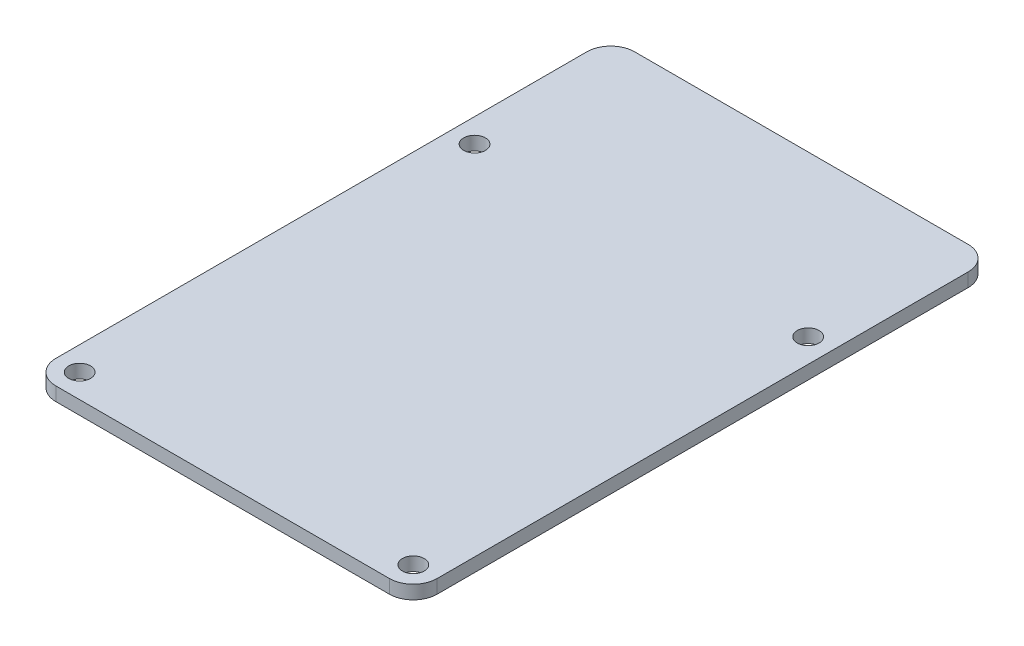
ISO-10303-21;
HEADER;
FILE_DESCRIPTION(('STEP AP214'),'2;1');
FILE_NAME('part.step','',(''),(''),'','','');
FILE_SCHEMA(('AUTOMOTIVE_DESIGN { 1 0 10303 214 1 1 1 1 }'));
ENDSEC;
DATA;
#1=APPLICATION_CONTEXT('core data for automotive mechanical design processes');
#2=APPLICATION_PROTOCOL_DEFINITION('international standard','automotive_design',2000,#1);
#3=PRODUCT_CONTEXT('',#1,'mechanical');
#4=PRODUCT('Part','Part','',(#3));
#5=PRODUCT_RELATED_PRODUCT_CATEGORY('part','',(#4));
#6=PRODUCT_DEFINITION_FORMATION('','',#4);
#7=PRODUCT_DEFINITION_CONTEXT('part definition',#1,'design');
#8=PRODUCT_DEFINITION('design','',#6,#7);
#9=PRODUCT_DEFINITION_SHAPE('','',#8);
#10=(LENGTH_UNIT() NAMED_UNIT(*) SI_UNIT(.MILLI.,.METRE.));
#11=(NAMED_UNIT(*) PLANE_ANGLE_UNIT() SI_UNIT($,.RADIAN.));
#12=(NAMED_UNIT(*) SI_UNIT($,.STERADIAN.) SOLID_ANGLE_UNIT());
#13=UNCERTAINTY_MEASURE_WITH_UNIT(LENGTH_MEASURE(1.E-05),#10,'distance_accuracy_value','');
#14=(GEOMETRIC_REPRESENTATION_CONTEXT(3) GLOBAL_UNCERTAINTY_ASSIGNED_CONTEXT((#13)) GLOBAL_UNIT_ASSIGNED_CONTEXT((#10,
#11,#12)) REPRESENTATION_CONTEXT('',''));
#15=CARTESIAN_POINT('',(0.,0.,0.));
#16=DIRECTION('',(0.,0.,1.));
#17=DIRECTION('',(1.,0.,0.));
#18=AXIS2_PLACEMENT_3D('',#15,#16,#17);
#19=CARTESIAN_POINT('',(0.,2.,0.));
#20=DIRECTION('',(0.,-1.,0.));
#21=DIRECTION('',(0.,0.,-1.));
#22=AXIS2_PLACEMENT_3D('',#19,#20,#21);
#23=PLANE('',#22);
#24=DIRECTION('',(-1.,0.,0.));
#25=VECTOR('',#24,1.);
#26=CARTESIAN_POINT('',(-28.,2.,-42.5));
#27=LINE('',#26,#25);
#28=CARTESIAN_POINT('',(24.5,2.,-42.5));
#29=VERTEX_POINT('',#28);
#30=CARTESIAN_POINT('',(-24.5,2.,-42.5));
#31=VERTEX_POINT('',#30);
#32=EDGE_CURVE('E210',#29,#31,#27,.T.);
#33=ORIENTED_EDGE('',*,*,#32,.T.);
#34=CARTESIAN_POINT('',(-24.5,2.,-39.));
#35=DIRECTION('',(0.,-1.,0.));
#36=DIRECTION('',(0.,0.,-1.));
#37=AXIS2_PLACEMENT_3D('',#34,#35,#36);
#38=CIRCLE('',#37,3.5);
#39=CARTESIAN_POINT('',(-28.,2.,-39.));
#40=VERTEX_POINT('',#39);
#41=EDGE_CURVE('E173',#31,#40,#38,.F.);
#42=ORIENTED_EDGE('',*,*,#41,.T.);
#43=DIRECTION('',(0.,0.,1.));
#44=VECTOR('',#43,1.);
#45=CARTESIAN_POINT('',(-28.,2.,42.5));
#46=LINE('',#45,#44);
#47=CARTESIAN_POINT('',(-28.,2.,39.));
#48=VERTEX_POINT('',#47);
#49=EDGE_CURVE('E136',#40,#48,#46,.T.);
#50=ORIENTED_EDGE('',*,*,#49,.T.);
#51=CARTESIAN_POINT('',(-24.5,2.,39.));
#52=DIRECTION('',(0.,-1.,0.));
#53=DIRECTION('',(0.,0.,-1.));
#54=AXIS2_PLACEMENT_3D('',#51,#52,#53);
#55=CIRCLE('',#54,3.5);
#56=CARTESIAN_POINT('',(-24.5,2.,42.5));
#57=VERTEX_POINT('',#56);
#58=EDGE_CURVE('E68',#48,#57,#55,.F.);
#59=ORIENTED_EDGE('',*,*,#58,.T.);
#60=DIRECTION('',(1.,0.,0.));
#61=VECTOR('',#60,1.);
#62=CARTESIAN_POINT('',(-28.,2.,42.5));
#63=LINE('',#62,#61);
#64=CARTESIAN_POINT('',(24.5,2.,42.5));
#65=VERTEX_POINT('',#64);
#66=EDGE_CURVE('E156',#57,#65,#63,.T.);
#67=ORIENTED_EDGE('',*,*,#66,.T.);
#68=CARTESIAN_POINT('',(24.5,2.,39.));
#69=DIRECTION('',(0.,-1.,0.));
#70=DIRECTION('',(0.,0.,-1.));
#71=AXIS2_PLACEMENT_3D('',#68,#69,#70);
#72=CIRCLE('',#71,3.5);
#73=CARTESIAN_POINT('',(28.,2.,39.));
#74=VERTEX_POINT('',#73);
#75=EDGE_CURVE('E166',#65,#74,#72,.F.);
#76=ORIENTED_EDGE('',*,*,#75,.T.);
#77=DIRECTION('',(0.,0.,-1.));
#78=VECTOR('',#77,1.);
#79=CARTESIAN_POINT('',(28.,2.,42.5));
#80=LINE('',#79,#78);
#81=CARTESIAN_POINT('',(28.,2.,-39.));
#82=VERTEX_POINT('',#81);
#83=EDGE_CURVE('E150',#74,#82,#80,.T.);
#84=ORIENTED_EDGE('',*,*,#83,.T.);
#85=CARTESIAN_POINT('',(24.5,2.,-39.));
#86=DIRECTION('',(0.,-1.,0.));
#87=DIRECTION('',(0.,0.,-1.));
#88=AXIS2_PLACEMENT_3D('',#85,#86,#87);
#89=CIRCLE('',#88,3.5);
#90=EDGE_CURVE('E170',#82,#29,#89,.F.);
#91=ORIENTED_EDGE('',*,*,#90,.T.);
#92=EDGE_LOOP('',(#33,#42,#50,#59,#67,#76,#84,#91));
#93=FACE_BOUND('',#92,.T.);
#94=CARTESIAN_POINT('',(24.5,2.,-19.));
#95=DIRECTION('',(0.,1.,0.));
#96=DIRECTION('',(0.,0.,1.));
#97=AXIS2_PLACEMENT_3D('',#94,#95,#96);
#98=CIRCLE('',#97,1.6);
#99=CARTESIAN_POINT('',(24.5,2.,-17.4));
#100=VERTEX_POINT('',#99);
#101=EDGE_CURVE('E201',#100,#100,#98,.T.);
#102=ORIENTED_EDGE('',*,*,#101,.F.);
#103=EDGE_LOOP('',(#102));
#104=FACE_BOUND('',#103,.T.);
#105=CARTESIAN_POINT('',(-24.5,2.,39.));
#106=DIRECTION('',(0.,1.,0.));
#107=DIRECTION('',(0.,0.,1.));
#108=AXIS2_PLACEMENT_3D('',#105,#106,#107);
#109=CIRCLE('',#108,1.6);
#110=CARTESIAN_POINT('',(-24.5,2.,40.6));
#111=VERTEX_POINT('',#110);
#112=EDGE_CURVE('E189',#111,#111,#109,.T.);
#113=ORIENTED_EDGE('',*,*,#112,.F.);
#114=EDGE_LOOP('',(#113));
#115=FACE_BOUND('',#114,.T.);
#116=CARTESIAN_POINT('',(24.5,2.,39.));
#117=DIRECTION('',(0.,1.,0.));
#118=DIRECTION('',(0.,0.,1.));
#119=AXIS2_PLACEMENT_3D('',#116,#117,#118);
#120=CIRCLE('',#119,1.6);
#121=CARTESIAN_POINT('',(24.5,2.,40.6));
#122=VERTEX_POINT('',#121);
#123=EDGE_CURVE('E182',#122,#122,#120,.T.);
#124=ORIENTED_EDGE('',*,*,#123,.F.);
#125=EDGE_LOOP('',(#124));
#126=FACE_BOUND('',#125,.T.);
#127=CARTESIAN_POINT('',(-24.5,2.,-19.));
#128=DIRECTION('',(0.,1.,0.));
#129=DIRECTION('',(0.,0.,1.));
#130=AXIS2_PLACEMENT_3D('',#127,#128,#129);
#131=CIRCLE('',#130,1.6);
#132=CARTESIAN_POINT('',(-24.5,2.,-17.4));
#133=VERTEX_POINT('',#132);
#134=EDGE_CURVE('E300',#133,#133,#131,.T.);
#135=ORIENTED_EDGE('',*,*,#134,.F.);
#136=EDGE_LOOP('',(#135));
#137=FACE_BOUND('',#136,.T.);
#138=ADVANCED_FACE('F44',(#93,#104,#115,#126,#137),#23,.F.);
#139=CARTESIAN_POINT('',(28.,2.,42.5));
#140=DIRECTION('',(-1.,0.,0.));
#141=DIRECTION('',(0.,0.,1.));
#142=AXIS2_PLACEMENT_3D('',#139,#140,#141);
#143=PLANE('',#142);
#144=DIRECTION('',(0.,0.,-1.));
#145=VECTOR('',#144,1.);
#146=CARTESIAN_POINT('',(28.,0.,42.5));
#147=LINE('',#146,#145);
#148=CARTESIAN_POINT('',(28.,0.,39.));
#149=VERTEX_POINT('',#148);
#150=CARTESIAN_POINT('',(28.,0.,-39.));
#151=VERTEX_POINT('',#150);
#152=EDGE_CURVE('E152',#149,#151,#147,.T.);
#153=ORIENTED_EDGE('',*,*,#152,.T.);
#154=DIRECTION('',(0.,-1.,0.));
#155=VECTOR('',#154,1.);
#156=CARTESIAN_POINT('',(28.,2.,-39.));
#157=LINE('',#156,#155);
#158=EDGE_CURVE('E179',#151,#82,#157,.F.);
#159=ORIENTED_EDGE('',*,*,#158,.T.);
#160=ORIENTED_EDGE('',*,*,#83,.F.);
#161=DIRECTION('',(0.,-1.,0.));
#162=VECTOR('',#161,1.);
#163=CARTESIAN_POINT('',(28.,2.,39.));
#164=LINE('',#163,#162);
#165=EDGE_CURVE('E175',#74,#149,#164,.T.);
#166=ORIENTED_EDGE('',*,*,#165,.T.);
#167=EDGE_LOOP('',(#153,#159,#160,#166));
#168=FACE_BOUND('',#167,.T.);
#169=ADVANCED_FACE('F220',(#168),#143,.F.);
#170=CARTESIAN_POINT('',(-28.,2.,-42.5));
#171=DIRECTION('',(0.,0.,1.));
#172=DIRECTION('',(1.,0.,0.));
#173=AXIS2_PLACEMENT_3D('',#170,#171,#172);
#174=PLANE('',#173);
#175=DIRECTION('',(-1.,0.,0.));
#176=VECTOR('',#175,1.);
#177=CARTESIAN_POINT('',(-28.,0.,-42.5));
#178=LINE('',#177,#176);
#179=CARTESIAN_POINT('',(24.5,0.,-42.5));
#180=VERTEX_POINT('',#179);
#181=CARTESIAN_POINT('',(-24.5,0.,-42.5));
#182=VERTEX_POINT('',#181);
#183=EDGE_CURVE('E145',#180,#182,#178,.T.);
#184=ORIENTED_EDGE('',*,*,#183,.T.);
#185=DIRECTION('',(0.,-1.,0.));
#186=VECTOR('',#185,1.);
#187=CARTESIAN_POINT('',(-24.5,2.,-42.5));
#188=LINE('',#187,#186);
#189=EDGE_CURVE('E122',#182,#31,#188,.F.);
#190=ORIENTED_EDGE('',*,*,#189,.T.);
#191=ORIENTED_EDGE('',*,*,#32,.F.);
#192=DIRECTION('',(0.,-1.,0.));
#193=VECTOR('',#192,1.);
#194=CARTESIAN_POINT('',(24.5,2.,-42.5));
#195=LINE('',#194,#193);
#196=EDGE_CURVE('E127',#29,#180,#195,.T.);
#197=ORIENTED_EDGE('',*,*,#196,.T.);
#198=EDGE_LOOP('',(#184,#190,#191,#197));
#199=FACE_BOUND('',#198,.T.);
#200=ADVANCED_FACE('F230',(#199),#174,.F.);
#201=CARTESIAN_POINT('',(-28.,2.,42.5));
#202=DIRECTION('',(1.,0.,0.));
#203=DIRECTION('',(0.,0.,-1.));
#204=AXIS2_PLACEMENT_3D('',#201,#202,#203);
#205=PLANE('',#204);
#206=ORIENTED_EDGE('',*,*,#49,.F.);
#207=DIRECTION('',(0.,-1.,0.));
#208=VECTOR('',#207,1.);
#209=CARTESIAN_POINT('',(-28.,2.,-39.));
#210=LINE('',#209,#208);
#211=CARTESIAN_POINT('',(-28.,0.,-39.));
#212=VERTEX_POINT('',#211);
#213=EDGE_CURVE('E121',#40,#212,#210,.T.);
#214=ORIENTED_EDGE('',*,*,#213,.T.);
#215=DIRECTION('',(0.,0.,1.));
#216=VECTOR('',#215,1.);
#217=CARTESIAN_POINT('',(-28.,0.,42.5));
#218=LINE('',#217,#216);
#219=CARTESIAN_POINT('',(-28.,0.,39.));
#220=VERTEX_POINT('',#219);
#221=EDGE_CURVE('E134',#212,#220,#218,.T.);
#222=ORIENTED_EDGE('',*,*,#221,.T.);
#223=DIRECTION('',(0.,-1.,0.));
#224=VECTOR('',#223,1.);
#225=CARTESIAN_POINT('',(-28.,2.,39.));
#226=LINE('',#225,#224);
#227=EDGE_CURVE('E138',#220,#48,#226,.F.);
#228=ORIENTED_EDGE('',*,*,#227,.T.);
#229=EDGE_LOOP('',(#206,#214,#222,#228));
#230=FACE_BOUND('',#229,.T.);
#231=ADVANCED_FACE('F133',(#230),#205,.F.);
#232=CARTESIAN_POINT('',(-28.,2.,42.5));
#233=DIRECTION('',(0.,0.,-1.));
#234=DIRECTION('',(-1.,0.,0.));
#235=AXIS2_PLACEMENT_3D('',#232,#233,#234);
#236=PLANE('',#235);
#237=ORIENTED_EDGE('',*,*,#66,.F.);
#238=DIRECTION('',(0.,-1.,0.));
#239=VECTOR('',#238,1.);
#240=CARTESIAN_POINT('',(-24.5,2.,42.5));
#241=LINE('',#240,#239);
#242=CARTESIAN_POINT('',(-24.5,0.,42.5));
#243=VERTEX_POINT('',#242);
#244=EDGE_CURVE('E11',#57,#243,#241,.T.);
#245=ORIENTED_EDGE('',*,*,#244,.T.);
#246=DIRECTION('',(1.,0.,0.));
#247=VECTOR('',#246,1.);
#248=CARTESIAN_POINT('',(-28.,0.,42.5));
#249=LINE('',#248,#247);
#250=CARTESIAN_POINT('',(24.5,0.,42.5));
#251=VERTEX_POINT('',#250);
#252=EDGE_CURVE('E144',#243,#251,#249,.T.);
#253=ORIENTED_EDGE('',*,*,#252,.T.);
#254=DIRECTION('',(0.,-1.,0.));
#255=VECTOR('',#254,1.);
#256=CARTESIAN_POINT('',(24.5,2.,42.5));
#257=LINE('',#256,#255);
#258=EDGE_CURVE('E52',#251,#65,#257,.F.);
#259=ORIENTED_EDGE('',*,*,#258,.T.);
#260=EDGE_LOOP('',(#237,#245,#253,#259));
#261=FACE_BOUND('',#260,.T.);
#262=ADVANCED_FACE('F237',(#261),#236,.F.);
#263=CARTESIAN_POINT('',(0.,0.,0.));
#264=DIRECTION('',(0.,-1.,0.));
#265=DIRECTION('',(0.,0.,-1.));
#266=AXIS2_PLACEMENT_3D('',#263,#264,#265);
#267=PLANE('',#266);
#268=CARTESIAN_POINT('',(-24.5,0.,-19.));
#269=DIRECTION('',(0.,-1.,0.));
#270=DIRECTION('',(0.,0.,-1.));
#271=AXIS2_PLACEMENT_3D('',#268,#269,#270);
#272=CIRCLE('',#271,1.6);
#273=CARTESIAN_POINT('',(-24.5,0.,-20.6));
#274=VERTEX_POINT('',#273);
#275=EDGE_CURVE('E185',#274,#274,#272,.T.);
#276=ORIENTED_EDGE('',*,*,#275,.F.);
#277=EDGE_LOOP('',(#276));
#278=FACE_BOUND('',#277,.T.);
#279=CARTESIAN_POINT('',(24.5,0.,39.));
#280=DIRECTION('',(0.,-1.,0.));
#281=DIRECTION('',(0.,0.,-1.));
#282=AXIS2_PLACEMENT_3D('',#279,#280,#281);
#283=CIRCLE('',#282,1.6);
#284=CARTESIAN_POINT('',(24.5,0.,37.4));
#285=VERTEX_POINT('',#284);
#286=EDGE_CURVE('E184',#285,#285,#283,.T.);
#287=ORIENTED_EDGE('',*,*,#286,.F.);
#288=EDGE_LOOP('',(#287));
#289=FACE_BOUND('',#288,.T.);
#290=CARTESIAN_POINT('',(-24.5,0.,39.));
#291=DIRECTION('',(0.,-1.,0.));
#292=DIRECTION('',(0.,0.,-1.));
#293=AXIS2_PLACEMENT_3D('',#290,#291,#292);
#294=CIRCLE('',#293,1.6);
#295=CARTESIAN_POINT('',(-24.5,0.,37.4));
#296=VERTEX_POINT('',#295);
#297=EDGE_CURVE('E194',#296,#296,#294,.T.);
#298=ORIENTED_EDGE('',*,*,#297,.F.);
#299=EDGE_LOOP('',(#298));
#300=FACE_BOUND('',#299,.T.);
#301=CARTESIAN_POINT('',(24.5,0.,-19.));
#302=DIRECTION('',(0.,-1.,0.));
#303=DIRECTION('',(0.,0.,-1.));
#304=AXIS2_PLACEMENT_3D('',#301,#302,#303);
#305=CIRCLE('',#304,1.6);
#306=CARTESIAN_POINT('',(24.5,0.,-20.6));
#307=VERTEX_POINT('',#306);
#308=EDGE_CURVE('E204',#307,#307,#305,.T.);
#309=ORIENTED_EDGE('',*,*,#308,.F.);
#310=EDGE_LOOP('',(#309));
#311=FACE_BOUND('',#310,.T.);
#312=ORIENTED_EDGE('',*,*,#221,.F.);
#313=CARTESIAN_POINT('',(-24.5,0.,-39.));
#314=DIRECTION('',(0.,-1.,0.));
#315=DIRECTION('',(0.,0.,-1.));
#316=AXIS2_PLACEMENT_3D('',#313,#314,#315);
#317=CIRCLE('',#316,3.5);
#318=EDGE_CURVE('E117',#212,#182,#317,.T.);
#319=ORIENTED_EDGE('',*,*,#318,.T.);
#320=ORIENTED_EDGE('',*,*,#183,.F.);
#321=CARTESIAN_POINT('',(24.5,0.,-39.));
#322=DIRECTION('',(0.,-1.,0.));
#323=DIRECTION('',(0.,0.,-1.));
#324=AXIS2_PLACEMENT_3D('',#321,#322,#323);
#325=CIRCLE('',#324,3.5);
#326=EDGE_CURVE('E128',#180,#151,#325,.T.);
#327=ORIENTED_EDGE('',*,*,#326,.T.);
#328=ORIENTED_EDGE('',*,*,#152,.F.);
#329=CARTESIAN_POINT('',(24.5,0.,39.));
#330=DIRECTION('',(0.,-1.,0.));
#331=DIRECTION('',(0.,0.,-1.));
#332=AXIS2_PLACEMENT_3D('',#329,#330,#331);
#333=CIRCLE('',#332,3.5);
#334=EDGE_CURVE('E137',#149,#251,#333,.T.);
#335=ORIENTED_EDGE('',*,*,#334,.T.);
#336=ORIENTED_EDGE('',*,*,#252,.F.);
#337=CARTESIAN_POINT('',(-24.5,0.,39.));
#338=DIRECTION('',(0.,-1.,0.));
#339=DIRECTION('',(0.,0.,-1.));
#340=AXIS2_PLACEMENT_3D('',#337,#338,#339);
#341=CIRCLE('',#340,3.5);
#342=EDGE_CURVE('E142',#243,#220,#341,.T.);
#343=ORIENTED_EDGE('',*,*,#342,.T.);
#344=EDGE_LOOP('',(#312,#319,#320,#327,#328,#335,#336,#343));
#345=FACE_BOUND('',#344,.T.);
#346=ADVANCED_FACE('F140',(#278,#289,#300,#311,#345),#267,.T.);
#347=CARTESIAN_POINT('',(24.5,2.,-19.));
#348=DIRECTION('',(0.,1.,0.));
#349=DIRECTION('',(0.,0.,1.));
#350=AXIS2_PLACEMENT_3D('',#347,#348,#349);
#351=CYLINDRICAL_SURFACE('',#350,1.6);
#352=ORIENTED_EDGE('',*,*,#101,.T.);
#353=EDGE_LOOP('',(#352));
#354=FACE_BOUND('',#353,.T.);
#355=ORIENTED_EDGE('',*,*,#308,.T.);
#356=EDGE_LOOP('',(#355));
#357=FACE_BOUND('',#356,.T.);
#358=ADVANCED_FACE('F246',(#354,#357),#351,.F.);
#359=CARTESIAN_POINT('',(-24.5,2.,39.));
#360=DIRECTION('',(0.,1.,0.));
#361=DIRECTION('',(0.,0.,1.));
#362=AXIS2_PLACEMENT_3D('',#359,#360,#361);
#363=CYLINDRICAL_SURFACE('',#362,1.6);
#364=ORIENTED_EDGE('',*,*,#112,.T.);
#365=EDGE_LOOP('',(#364));
#366=FACE_BOUND('',#365,.T.);
#367=ORIENTED_EDGE('',*,*,#297,.T.);
#368=EDGE_LOOP('',(#367));
#369=FACE_BOUND('',#368,.T.);
#370=ADVANCED_FACE('F277',(#366,#369),#363,.F.);
#371=CARTESIAN_POINT('',(24.5,2.,39.));
#372=DIRECTION('',(0.,1.,0.));
#373=DIRECTION('',(0.,0.,1.));
#374=AXIS2_PLACEMENT_3D('',#371,#372,#373);
#375=CYLINDRICAL_SURFACE('',#374,1.6);
#376=ORIENTED_EDGE('',*,*,#123,.T.);
#377=EDGE_LOOP('',(#376));
#378=FACE_BOUND('',#377,.T.);
#379=ORIENTED_EDGE('',*,*,#286,.T.);
#380=EDGE_LOOP('',(#379));
#381=FACE_BOUND('',#380,.T.);
#382=ADVANCED_FACE('F271',(#378,#381),#375,.F.);
#383=CARTESIAN_POINT('',(-24.5,2.,-19.));
#384=DIRECTION('',(0.,1.,0.));
#385=DIRECTION('',(0.,0.,1.));
#386=AXIS2_PLACEMENT_3D('',#383,#384,#385);
#387=CYLINDRICAL_SURFACE('',#386,1.6);
#388=ORIENTED_EDGE('',*,*,#134,.T.);
#389=EDGE_LOOP('',(#388));
#390=FACE_BOUND('',#389,.T.);
#391=ORIENTED_EDGE('',*,*,#275,.T.);
#392=EDGE_LOOP('',(#391));
#393=FACE_BOUND('',#392,.T.);
#394=ADVANCED_FACE('F267',(#390,#393),#387,.F.);
#395=CARTESIAN_POINT('',(-24.5,2.,-39.));
#396=DIRECTION('',(0.,-1.,0.));
#397=DIRECTION('',(0.,0.,-1.));
#398=AXIS2_PLACEMENT_3D('',#395,#396,#397);
#399=CYLINDRICAL_SURFACE('',#398,3.5);
#400=ORIENTED_EDGE('',*,*,#41,.F.);
#401=ORIENTED_EDGE('',*,*,#189,.F.);
#402=ORIENTED_EDGE('',*,*,#318,.F.);
#403=ORIENTED_EDGE('',*,*,#213,.F.);
#404=EDGE_LOOP('',(#400,#401,#402,#403));
#405=FACE_BOUND('',#404,.T.);
#406=ADVANCED_FACE('F120',(#405),#399,.T.);
#407=CARTESIAN_POINT('',(24.5,2.,-39.));
#408=DIRECTION('',(0.,-1.,0.));
#409=DIRECTION('',(0.,0.,-1.));
#410=AXIS2_PLACEMENT_3D('',#407,#408,#409);
#411=CYLINDRICAL_SURFACE('',#410,3.5);
#412=ORIENTED_EDGE('',*,*,#90,.F.);
#413=ORIENTED_EDGE('',*,*,#158,.F.);
#414=ORIENTED_EDGE('',*,*,#326,.F.);
#415=ORIENTED_EDGE('',*,*,#196,.F.);
#416=EDGE_LOOP('',(#412,#413,#414,#415));
#417=FACE_BOUND('',#416,.T.);
#418=ADVANCED_FACE('F225',(#417),#411,.T.);
#419=CARTESIAN_POINT('',(-24.5,2.,39.));
#420=DIRECTION('',(0.,-1.,0.));
#421=DIRECTION('',(0.,0.,-1.));
#422=AXIS2_PLACEMENT_3D('',#419,#420,#421);
#423=CYLINDRICAL_SURFACE('',#422,3.5);
#424=ORIENTED_EDGE('',*,*,#58,.F.);
#425=ORIENTED_EDGE('',*,*,#227,.F.);
#426=ORIENTED_EDGE('',*,*,#342,.F.);
#427=ORIENTED_EDGE('',*,*,#244,.F.);
#428=EDGE_LOOP('',(#424,#425,#426,#427));
#429=FACE_BOUND('',#428,.T.);
#430=ADVANCED_FACE('F257',(#429),#423,.T.);
#431=CARTESIAN_POINT('',(24.5,2.,39.));
#432=DIRECTION('',(0.,-1.,0.));
#433=DIRECTION('',(0.,0.,-1.));
#434=AXIS2_PLACEMENT_3D('',#431,#432,#433);
#435=CYLINDRICAL_SURFACE('',#434,3.5);
#436=ORIENTED_EDGE('',*,*,#75,.F.);
#437=ORIENTED_EDGE('',*,*,#258,.F.);
#438=ORIENTED_EDGE('',*,*,#334,.F.);
#439=ORIENTED_EDGE('',*,*,#165,.F.);
#440=EDGE_LOOP('',(#436,#437,#438,#439));
#441=FACE_BOUND('',#440,.T.);
#442=ADVANCED_FACE('F46',(#441),#435,.T.);
#443=CLOSED_SHELL('',(#138,#169,#200,#231,#262,#346,#358,#370,#382,#394,#406,#418,#430,#442));
#444=MANIFOLD_SOLID_BREP('B2',#443);
#445=ADVANCED_BREP_SHAPE_REPRESENTATION('',(#18,#444),#14);
#446=SHAPE_DEFINITION_REPRESENTATION(#9,#445);
ENDSEC;
END-ISO-10303-21;
